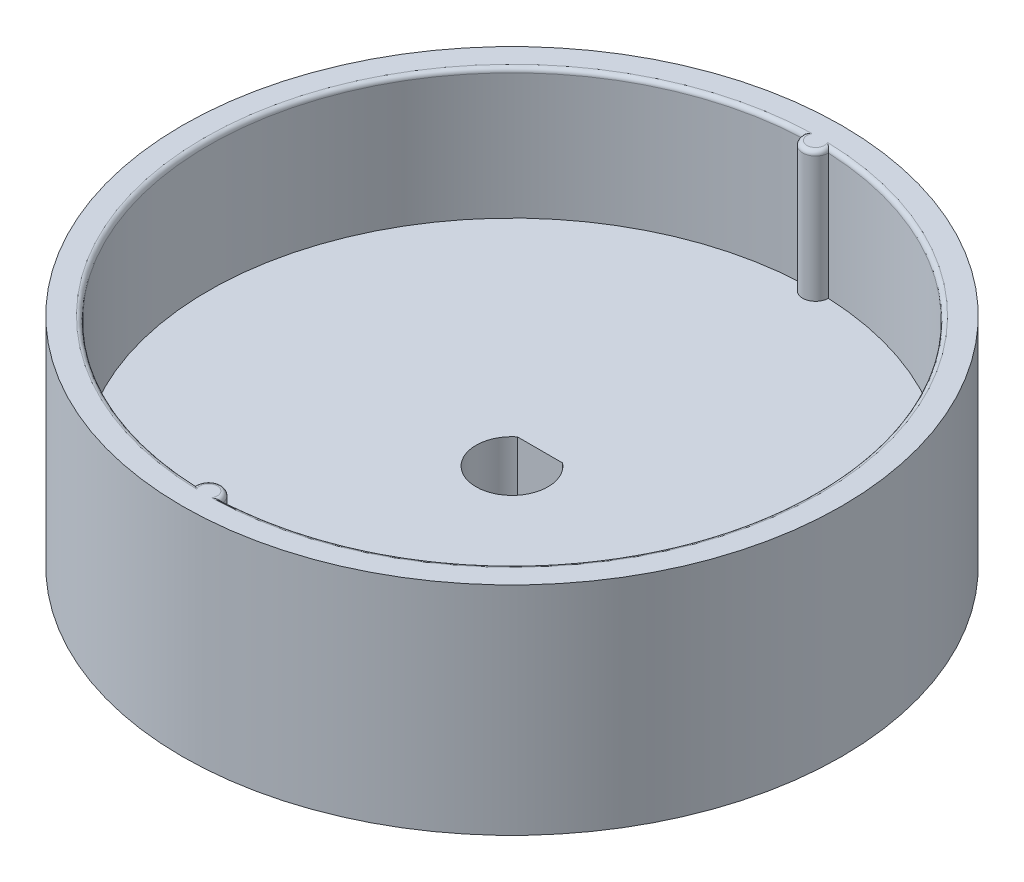
ISO-10303-21;
HEADER;
FILE_DESCRIPTION(('STEP AP214'),'2;1');
FILE_NAME('part.step','',(''),(''),'','','');
FILE_SCHEMA(('AUTOMOTIVE_DESIGN { 1 0 10303 214 1 1 1 1 }'));
ENDSEC;
DATA;
#1=APPLICATION_CONTEXT('core data for automotive mechanical design processes');
#2=APPLICATION_PROTOCOL_DEFINITION('international standard','automotive_design',2000,#1);
#3=PRODUCT_CONTEXT('',#1,'mechanical');
#4=PRODUCT('Part','Part','',(#3));
#5=PRODUCT_RELATED_PRODUCT_CATEGORY('part','',(#4));
#6=PRODUCT_DEFINITION_FORMATION('','',#4);
#7=PRODUCT_DEFINITION_CONTEXT('part definition',#1,'design');
#8=PRODUCT_DEFINITION('design','',#6,#7);
#9=PRODUCT_DEFINITION_SHAPE('','',#8);
#10=(LENGTH_UNIT() NAMED_UNIT(*) SI_UNIT(.MILLI.,.METRE.));
#11=(NAMED_UNIT(*) PLANE_ANGLE_UNIT() SI_UNIT($,.RADIAN.));
#12=(NAMED_UNIT(*) SI_UNIT($,.STERADIAN.) SOLID_ANGLE_UNIT());
#13=UNCERTAINTY_MEASURE_WITH_UNIT(LENGTH_MEASURE(1.E-05),#10,'distance_accuracy_value','');
#14=(GEOMETRIC_REPRESENTATION_CONTEXT(3) GLOBAL_UNCERTAINTY_ASSIGNED_CONTEXT((#13)) GLOBAL_UNIT_ASSIGNED_CONTEXT((#10,
#11,#12)) REPRESENTATION_CONTEXT('',''));
#15=CARTESIAN_POINT('',(0.,0.,0.));
#16=DIRECTION('',(0.,0.,1.));
#17=DIRECTION('',(1.,0.,0.));
#18=AXIS2_PLACEMENT_3D('',#15,#16,#17);
#19=CARTESIAN_POINT('',(0.,10.,0.));
#20=DIRECTION('',(0.,-1.,0.));
#21=DIRECTION('',(0.,0.,-1.));
#22=AXIS2_PLACEMENT_3D('',#19,#20,#21);
#23=CYLINDRICAL_SURFACE('',#22,4.15);
#24=DIRECTION('',(0.,-1.,0.));
#25=VECTOR('',#24,1.);
#26=CARTESIAN_POINT('',(2.61057837857858,10.,-3.22604719886397));
#27=LINE('',#26,#25);
#28=CARTESIAN_POINT('',(2.61057837857858,10.,-3.22604719886397));
#29=VERTEX_POINT('',#28);
#30=CARTESIAN_POINT('',(2.61057837857858,0.999999999999989,-3.22604719886397));
#31=VERTEX_POINT('',#30);
#32=EDGE_CURVE('E153',#29,#31,#27,.T.);
#33=ORIENTED_EDGE('',*,*,#32,.T.);
#34=CARTESIAN_POINT('',(0.,0.999999999999989,0.));
#35=DIRECTION('',(0.,1.,0.));
#36=DIRECTION('',(0.,0.,1.));
#37=AXIS2_PLACEMENT_3D('',#34,#35,#36);
#38=CIRCLE('',#37,4.15);
#39=CARTESIAN_POINT('',(-2.61057837857858,0.999999999999989,-3.22604719886397));
#40=VERTEX_POINT('',#39);
#41=EDGE_CURVE('E11',#31,#40,#38,.F.);
#42=ORIENTED_EDGE('',*,*,#41,.T.);
#43=DIRECTION('',(0.,-1.,0.));
#44=VECTOR('',#43,1.);
#45=CARTESIAN_POINT('',(-2.61057837857858,10.,-3.22604719886397));
#46=LINE('',#45,#44);
#47=CARTESIAN_POINT('',(-2.61057837857858,10.,-3.22604719886397));
#48=VERTEX_POINT('',#47);
#49=EDGE_CURVE('E155',#48,#40,#46,.T.);
#50=ORIENTED_EDGE('',*,*,#49,.F.);
#51=CARTESIAN_POINT('',(0.,10.,0.));
#52=DIRECTION('',(0.,1.,0.));
#53=DIRECTION('',(0.,0.,1.));
#54=AXIS2_PLACEMENT_3D('',#51,#52,#53);
#55=CIRCLE('',#54,4.15);
#56=EDGE_CURVE('E144',#48,#29,#55,.T.);
#57=ORIENTED_EDGE('',*,*,#56,.T.);
#58=EDGE_LOOP('',(#33,#42,#50,#57));
#59=FACE_BOUND('',#58,.T.);
#60=ADVANCED_FACE('F38',(#59),#23,.F.);
#61=CARTESIAN_POINT('',(0.,10.,-3.22604719886397));
#62=DIRECTION('',(0.,0.,1.));
#63=DIRECTION('',(1.,0.,0.));
#64=AXIS2_PLACEMENT_3D('',#61,#62,#63);
#65=PLANE('',#64);
#66=ORIENTED_EDGE('',*,*,#49,.T.);
#67=DIRECTION('',(1.,0.,0.));
#68=VECTOR('',#67,1.);
#69=CARTESIAN_POINT('',(2.61057837857858,0.999999999999989,-3.22604719886397));
#70=LINE('',#69,#68);
#71=EDGE_CURVE('E53',#40,#31,#70,.T.);
#72=ORIENTED_EDGE('',*,*,#71,.T.);
#73=ORIENTED_EDGE('',*,*,#32,.F.);
#74=DIRECTION('',(-1.,0.,0.));
#75=VECTOR('',#74,1.);
#76=CARTESIAN_POINT('',(0.,10.,-3.22604719886397));
#77=LINE('',#76,#75);
#78=EDGE_CURVE('E150',#29,#48,#77,.T.);
#79=ORIENTED_EDGE('',*,*,#78,.T.);
#80=EDGE_LOOP('',(#66,#72,#73,#79));
#81=FACE_BOUND('',#80,.T.);
#82=ADVANCED_FACE('F242',(#81),#65,.T.);
#83=CARTESIAN_POINT('',(0.,10.,0.));
#84=DIRECTION('',(0.,1.,0.));
#85=DIRECTION('',(0.,0.,1.));
#86=AXIS2_PLACEMENT_3D('',#83,#84,#85);
#87=PLANE('',#86);
#88=CARTESIAN_POINT('',(-0.000344427298581058,10.,34.9678571428571));
#89=DIRECTION('',(0.,1.,0.));
#90=DIRECTION('',(0.,0.,1.));
#91=AXIS2_PLACEMENT_3D('',#88,#89,#90);
#92=CIRCLE('',#91,1.5);
#93=CARTESIAN_POINT('',(1.49965557270142,10.,34.9678571428571));
#94=VERTEX_POINT('',#93);
#95=CARTESIAN_POINT('',(-1.50034442728045,10.,34.9678497639661));
#96=VERTEX_POINT('',#95);
#97=EDGE_CURVE('E138',#94,#96,#92,.T.);
#98=ORIENTED_EDGE('',*,*,#97,.F.);
#99=CARTESIAN_POINT('',(0.,10.,0.));
#100=DIRECTION('',(0.,1.,0.));
#101=DIRECTION('',(0.,0.,1.));
#102=AXIS2_PLACEMENT_3D('',#99,#100,#101);
#103=CIRCLE('',#102,35.);
#104=CARTESIAN_POINT('',(1.49965557270142,10.,-34.9678571428572));
#105=VERTEX_POINT('',#104);
#106=EDGE_CURVE('E120',#94,#105,#103,.T.);
#107=ORIENTED_EDGE('',*,*,#106,.T.);
#108=CARTESIAN_POINT('',(0.,10.,-35.));
#109=DIRECTION('',(0.,1.,0.));
#110=DIRECTION('',(0.,0.,1.));
#111=AXIS2_PLACEMENT_3D('',#108,#109,#110);
#112=CIRCLE('',#111,1.49999999999991);
#113=CARTESIAN_POINT('',(-1.49965604729446,10.,-34.9678792930825));
#114=VERTEX_POINT('',#113);
#115=EDGE_CURVE('E135',#114,#105,#112,.T.);
#116=ORIENTED_EDGE('',*,*,#115,.F.);
#117=CARTESIAN_POINT('',(0.,10.,0.));
#118=DIRECTION('',(0.,1.,0.));
#119=DIRECTION('',(0.,0.,1.));
#120=AXIS2_PLACEMENT_3D('',#117,#118,#119);
#121=CIRCLE('',#120,35.0000221502184);
#122=EDGE_CURVE('E142',#114,#96,#121,.T.);
#123=ORIENTED_EDGE('',*,*,#122,.T.);
#124=EDGE_LOOP('',(#98,#107,#116,#123));
#125=FACE_BOUND('',#124,.T.);
#126=ORIENTED_EDGE('',*,*,#56,.F.);
#127=ORIENTED_EDGE('',*,*,#78,.F.);
#128=EDGE_LOOP('',(#126,#127));
#129=FACE_BOUND('',#128,.T.);
#130=ADVANCED_FACE('F132',(#125,#129),#87,.T.);
#131=CARTESIAN_POINT('',(0.,0.,0.));
#132=DIRECTION('',(0.,1.,0.));
#133=DIRECTION('',(0.,0.,1.));
#134=AXIS2_PLACEMENT_3D('',#131,#132,#133);
#135=PLANE('',#134);
#136=CARTESIAN_POINT('',(0.,0.,0.));
#137=DIRECTION('',(0.,1.,0.));
#138=DIRECTION('',(0.,0.,1.));
#139=AXIS2_PLACEMENT_3D('',#136,#137,#138);
#140=CIRCLE('',#139,5.14999999999999);
#141=CARTESIAN_POINT('',(-2.94330172985611,0.,-4.22604719886395));
#142=VERTEX_POINT('',#141);
#143=CARTESIAN_POINT('',(2.94330172985611,0.,-4.22604719886396));
#144=VERTEX_POINT('',#143);
#145=EDGE_CURVE('E174',#142,#144,#140,.T.);
#146=ORIENTED_EDGE('',*,*,#145,.T.);
#147=DIRECTION('',(-1.,0.,0.));
#148=VECTOR('',#147,1.);
#149=CARTESIAN_POINT('',(-2.61057837857858,0.,-4.22604719886395));
#150=LINE('',#149,#148);
#151=EDGE_CURVE('E221',#144,#142,#150,.T.);
#152=ORIENTED_EDGE('',*,*,#151,.T.);
#153=EDGE_LOOP('',(#146,#152));
#154=FACE_BOUND('',#153,.T.);
#155=CARTESIAN_POINT('',(0.,0.,0.));
#156=DIRECTION('',(0.,1.,0.));
#157=DIRECTION('',(0.,0.,1.));
#158=AXIS2_PLACEMENT_3D('',#155,#156,#157);
#159=CIRCLE('',#158,38.);
#160=CARTESIAN_POINT('',(0.,0.,38.));
#161=VERTEX_POINT('',#160);
#162=EDGE_CURVE('E214',#161,#161,#159,.T.);
#163=ORIENTED_EDGE('',*,*,#162,.F.);
#164=EDGE_LOOP('',(#163));
#165=FACE_BOUND('',#164,.T.);
#166=ADVANCED_FACE('F249',(#154,#165),#135,.F.);
#167=CARTESIAN_POINT('',(0.,25.,0.));
#168=DIRECTION('',(0.,-1.,0.));
#169=DIRECTION('',(0.,0.,-1.));
#170=AXIS2_PLACEMENT_3D('',#167,#168,#169);
#171=CYLINDRICAL_SURFACE('',#170,35.);
#172=DIRECTION('',(0.,-1.,0.));
#173=VECTOR('',#172,1.);
#174=CARTESIAN_POINT('',(1.49965557270142,25.,34.9678571428571));
#175=LINE('',#174,#173);
#176=CARTESIAN_POINT('',(1.49965557270142,24.5,34.9678571428571));
#177=VERTEX_POINT('',#176);
#178=EDGE_CURVE('E290',#177,#94,#175,.T.);
#179=ORIENTED_EDGE('',*,*,#178,.F.);
#180=CARTESIAN_POINT('',(0.,24.5,0.));
#181=DIRECTION('',(0.,1.,0.));
#182=DIRECTION('',(0.,0.,1.));
#183=AXIS2_PLACEMENT_3D('',#180,#181,#182);
#184=CIRCLE('',#183,35.);
#185=CARTESIAN_POINT('',(1.49965557270142,24.5,-34.9678571428572));
#186=VERTEX_POINT('',#185);
#187=EDGE_CURVE('E122',#177,#186,#184,.T.);
#188=ORIENTED_EDGE('',*,*,#187,.T.);
#189=DIRECTION('',(0.,-1.,0.));
#190=VECTOR('',#189,1.);
#191=CARTESIAN_POINT('',(1.49965557270142,25.,-34.9678571428572));
#192=LINE('',#191,#190);
#193=EDGE_CURVE('E116',#186,#105,#192,.T.);
#194=ORIENTED_EDGE('',*,*,#193,.T.);
#195=ORIENTED_EDGE('',*,*,#106,.F.);
#196=EDGE_LOOP('',(#179,#188,#194,#195));
#197=FACE_BOUND('',#196,.T.);
#198=ADVANCED_FACE('F119',(#197),#171,.F.);
#199=CARTESIAN_POINT('',(-0.000344427298581058,25.,34.9678571428571));
#200=DIRECTION('',(0.,-1.,0.));
#201=DIRECTION('',(0.,0.,-1.));
#202=AXIS2_PLACEMENT_3D('',#199,#200,#201);
#203=CYLINDRICAL_SURFACE('',#202,1.5);
#204=DIRECTION('',(0.,-1.,0.));
#205=VECTOR('',#204,1.);
#206=CARTESIAN_POINT('',(-1.50034442728045,25.,34.9678497639661));
#207=LINE('',#206,#205);
#208=CARTESIAN_POINT('',(-1.50034442728045,24.5,34.9678497639661));
#209=VERTEX_POINT('',#208);
#210=EDGE_CURVE('E288',#209,#96,#207,.T.);
#211=ORIENTED_EDGE('',*,*,#210,.F.);
#212=CARTESIAN_POINT('',(-0.000344427298581058,24.5,34.9678571428571));
#213=DIRECTION('',(0.,1.,0.));
#214=DIRECTION('',(0.,0.,1.));
#215=AXIS2_PLACEMENT_3D('',#212,#213,#214);
#216=CIRCLE('',#215,1.5);
#217=EDGE_CURVE('E166',#209,#177,#216,.F.);
#218=ORIENTED_EDGE('',*,*,#217,.T.);
#219=ORIENTED_EDGE('',*,*,#178,.T.);
#220=ORIENTED_EDGE('',*,*,#97,.T.);
#221=EDGE_LOOP('',(#211,#218,#219,#220));
#222=FACE_BOUND('',#221,.T.);
#223=ADVANCED_FACE('F262',(#222),#203,.T.);
#224=CARTESIAN_POINT('',(0.,25.,0.));
#225=DIRECTION('',(0.,-1.,0.));
#226=DIRECTION('',(0.,0.,-1.));
#227=AXIS2_PLACEMENT_3D('',#224,#225,#226);
#228=CYLINDRICAL_SURFACE('',#227,35.0000221502184);
#229=DIRECTION('',(0.,-1.,0.));
#230=VECTOR('',#229,1.);
#231=CARTESIAN_POINT('',(-1.49965604729446,25.,-34.9678792930825));
#232=LINE('',#231,#230);
#233=CARTESIAN_POINT('',(-1.49965604729446,24.5,-34.9678792930825));
#234=VERTEX_POINT('',#233);
#235=EDGE_CURVE('E126',#234,#114,#232,.T.);
#236=ORIENTED_EDGE('',*,*,#235,.F.);
#237=CARTESIAN_POINT('',(0.,24.5,0.));
#238=DIRECTION('',(0.,1.,0.));
#239=DIRECTION('',(0.,0.,1.));
#240=AXIS2_PLACEMENT_3D('',#237,#238,#239);
#241=CIRCLE('',#240,35.0000221502184);
#242=EDGE_CURVE('E170',#234,#209,#241,.T.);
#243=ORIENTED_EDGE('',*,*,#242,.T.);
#244=ORIENTED_EDGE('',*,*,#210,.T.);
#245=ORIENTED_EDGE('',*,*,#122,.F.);
#246=EDGE_LOOP('',(#236,#243,#244,#245));
#247=FACE_BOUND('',#246,.T.);
#248=ADVANCED_FACE('F258',(#247),#228,.F.);
#249=CARTESIAN_POINT('',(0.,25.,0.));
#250=DIRECTION('',(0.,-1.,0.));
#251=DIRECTION('',(0.,0.,-1.));
#252=AXIS2_PLACEMENT_3D('',#249,#250,#251);
#253=CYLINDRICAL_SURFACE('',#252,38.);
#254=CARTESIAN_POINT('',(0.,25.,0.));
#255=DIRECTION('',(0.,1.,0.));
#256=DIRECTION('',(0.,0.,1.));
#257=AXIS2_PLACEMENT_3D('',#254,#255,#256);
#258=CIRCLE('',#257,38.);
#259=CARTESIAN_POINT('',(0.,25.,38.));
#260=VERTEX_POINT('',#259);
#261=EDGE_CURVE('E127',#260,#260,#258,.T.);
#262=ORIENTED_EDGE('',*,*,#261,.F.);
#263=EDGE_LOOP('',(#262));
#264=FACE_BOUND('',#263,.T.);
#265=ORIENTED_EDGE('',*,*,#162,.T.);
#266=EDGE_LOOP('',(#265));
#267=FACE_BOUND('',#266,.T.);
#268=ADVANCED_FACE('F255',(#264,#267),#253,.T.);
#269=CARTESIAN_POINT('',(0.,25.,-35.));
#270=DIRECTION('',(0.,-1.,0.));
#271=DIRECTION('',(0.,0.,-1.));
#272=AXIS2_PLACEMENT_3D('',#269,#270,#271);
#273=CYLINDRICAL_SURFACE('',#272,1.49999999999991);
#274=ORIENTED_EDGE('',*,*,#193,.F.);
#275=CARTESIAN_POINT('',(0.,24.5,-35.));
#276=DIRECTION('',(0.,1.,0.));
#277=DIRECTION('',(0.,0.,1.));
#278=AXIS2_PLACEMENT_3D('',#275,#276,#277);
#279=CIRCLE('',#278,1.49999999999991);
#280=EDGE_CURVE('E172',#186,#234,#279,.F.);
#281=ORIENTED_EDGE('',*,*,#280,.T.);
#282=ORIENTED_EDGE('',*,*,#235,.T.);
#283=ORIENTED_EDGE('',*,*,#115,.T.);
#284=EDGE_LOOP('',(#274,#281,#282,#283));
#285=FACE_BOUND('',#284,.T.);
#286=ADVANCED_FACE('F140',(#285),#273,.T.);
#287=CARTESIAN_POINT('',(0.,25.,0.));
#288=DIRECTION('',(0.,1.,0.));
#289=DIRECTION('',(0.,0.,1.));
#290=AXIS2_PLACEMENT_3D('',#287,#288,#289);
#291=PLANE('',#290);
#292=CARTESIAN_POINT('',(0.,25.,0.));
#293=DIRECTION('',(0.,1.,0.));
#294=DIRECTION('',(0.,0.,1.));
#295=AXIS2_PLACEMENT_3D('',#292,#293,#294);
#296=CIRCLE('',#295,35.5);
#297=CARTESIAN_POINT('',(0.872123551909785,25.,-35.4892857142857));
#298=VERTEX_POINT('',#297);
#299=CARTESIAN_POINT('',(0.852661330255749,25.,35.4897586446553));
#300=VERTEX_POINT('',#299);
#301=EDGE_CURVE('E161',#298,#300,#296,.F.);
#302=ORIENTED_EDGE('',*,*,#301,.T.);
#303=CARTESIAN_POINT('',(-0.000344427298581058,25.,34.9678571428571));
#304=DIRECTION('',(0.,1.,0.));
#305=DIRECTION('',(0.,0.,1.));
#306=AXIS2_PLACEMENT_3D('',#303,#304,#305);
#307=CIRCLE('',#306,1.);
#308=CARTESIAN_POINT('',(-0.853346707489282,25.,35.4897643280822));
#309=VERTEX_POINT('',#308);
#310=EDGE_CURVE('E163',#300,#309,#307,.T.);
#311=ORIENTED_EDGE('',*,*,#310,.T.);
#312=CARTESIAN_POINT('',(0.,25.,0.));
#313=DIRECTION('',(0.,1.,0.));
#314=DIRECTION('',(0.,0.,1.));
#315=AXIS2_PLACEMENT_3D('',#312,#313,#314);
#316=CIRCLE('',#315,35.5000221502184);
#317=CARTESIAN_POINT('',(-0.872110947106091,25.,-35.4893081809428));
#318=VERTEX_POINT('',#317);
#319=EDGE_CURVE('E159',#309,#318,#316,.F.);
#320=ORIENTED_EDGE('',*,*,#319,.T.);
#321=CARTESIAN_POINT('',(0.,25.,-35.));
#322=DIRECTION('',(0.,1.,0.));
#323=DIRECTION('',(0.,0.,1.));
#324=AXIS2_PLACEMENT_3D('',#321,#322,#323);
#325=CIRCLE('',#324,0.999999999999911);
#326=EDGE_CURVE('E157',#318,#298,#325,.T.);
#327=ORIENTED_EDGE('',*,*,#326,.T.);
#328=EDGE_LOOP('',(#302,#311,#320,#327));
#329=FACE_BOUND('',#328,.T.);
#330=ORIENTED_EDGE('',*,*,#261,.T.);
#331=EDGE_LOOP('',(#330));
#332=FACE_BOUND('',#331,.T.);
#333=ADVANCED_FACE('F271',(#329,#332),#291,.T.);
#334=CARTESIAN_POINT('',(0.,24.5,-35.));
#335=DIRECTION('',(0.,1.,0.));
#336=DIRECTION('',(0.,0.,1.));
#337=AXIS2_PLACEMENT_3D('',#334,#335,#336);
#338=TOROIDAL_SURFACE('',#337,0.999999999999911,0.5);
#339=CARTESIAN_POINT('',(-1.49965604729446,24.5,-34.9678792930825));
#340=CARTESIAN_POINT('',(-1.49968510968335,24.5219686152297,-34.9678400185327));
#341=CARTESIAN_POINT('',(-1.49824276810822,24.5438890449089,-34.9693865974401));
#342=CARTESIAN_POINT('',(-1.49266716930117,24.586818677745,-34.9753186199488));
#343=CARTESIAN_POINT('',(-1.48855533408124,24.6078337268752,-34.979681462169));
#344=CARTESIAN_POINT('',(-1.47789776299629,24.6484602732177,-34.9909097541989));
#345=CARTESIAN_POINT('',(-1.47135755620936,24.6680748391016,-34.9977695181583));
#346=CARTESIAN_POINT('',(-1.45617404730387,24.7056156718491,-35.013540515685));
#347=CARTESIAN_POINT('',(-1.44752658312126,24.7235384989372,-35.0224558072441));
#348=CARTESIAN_POINT('',(-1.42495375549343,24.7637310246039,-35.0454529239525));
#349=CARTESIAN_POINT('',(-1.41025755982334,24.7851702624031,-35.0602282263967));
#350=CARTESIAN_POINT('',(-1.37832271242707,24.8244211193011,-35.0916982895244));
#351=CARTESIAN_POINT('',(-1.36107981768764,24.8422265639518,-35.10839624307));
#352=CARTESIAN_POINT('',(-1.3168211049268,24.8813130828523,-35.1502792799531));
#353=CARTESIAN_POINT('',(-1.28878272917472,24.9008162084063,-35.1760361583146));
#354=CARTESIAN_POINT('',(-1.22985267588707,24.933784467943,-35.2281163214808));
#355=CARTESIAN_POINT('',(-1.19895515053014,24.9472368819098,-35.2544406787223));
#356=CARTESIAN_POINT('',(-1.12199100933566,24.973532907572,-35.3171839607803));
#357=CARTESIAN_POINT('',(-1.07487604181798,24.9838918882704,-35.3533424598639));
#358=CARTESIAN_POINT('',(-0.977648379898187,24.9970481873393,-35.4226356818184));
#359=CARTESIAN_POINT('',(-0.927538365601914,24.9998521657125,-35.4557730430114));
#360=CARTESIAN_POINT('',(-0.874864415061139,24.9999980982767,-35.487648030681));
#361=CARTESIAN_POINT('',(-0.873488105125747,24.9999999952838,-35.4884788645733));
#362=CARTESIAN_POINT('',(-0.87211094710609,25.,-35.4893081809428));
#363=B_SPLINE_CURVE_WITH_KNOTS('',3,(#339,#340,#341,#342,#343,#344,#345,#346,#347,#348,#349,
#350,#351,#352,#353,#354,#355,#356,#357,#358,#359,#360,#361,#362),.UNSPECIFIED.,.F.,.F.,(4,2,2,
2,2,2,2,2,2,2,2,4),(0.,0.0657279068460849,0.130934776689787,0.195994080633927,0.261182940428459,
0.350382871630335,0.439733129784174,0.5673544875939,0.695242895659755,0.875275512336338,
1.05514937186774,1.05997229094906),.UNSPECIFIED.);
#364=EDGE_CURVE('E215',#234,#318,#363,.T.);
#365=ORIENTED_EDGE('',*,*,#364,.F.);
#366=ORIENTED_EDGE('',*,*,#280,.F.);
#367=CARTESIAN_POINT('',(1.49965557270142,24.5,-34.9678571428571));
#368=CARTESIAN_POINT('',(1.49968463451634,24.5219687165264,-34.9678178683996));
#369=CARTESIAN_POINT('',(1.49824230224663,24.5438892483236,-34.9693644602242));
#370=CARTESIAN_POINT('',(1.49266673640202,24.5868190877111,-34.97529653562));
#371=CARTESIAN_POINT('',(1.48855492436185,24.6078342411745,-34.9796594179778));
#372=CARTESIAN_POINT('',(1.47789740845996,24.6484609956063,-34.9908878187629));
#373=CARTESIAN_POINT('',(1.47135723350745,24.6680756651677,-34.9977476514283));
#374=CARTESIAN_POINT('',(1.4561737916958,24.7056166981965,-35.0135188143977));
#375=CARTESIAN_POINT('',(1.44752636285934,24.723539621942,-35.0224342026713));
#376=CARTESIAN_POINT('',(1.42495366952902,24.7637322701566,-35.0454315266128));
#377=CARTESIAN_POINT('',(1.41025758550147,24.7851715428366,-35.0602069391594));
#378=CARTESIAN_POINT('',(1.37832297065521,24.8244224641013,-35.091677250436));
#379=CARTESIAN_POINT('',(1.36108019687798,24.8422279382873,-35.1083753420452));
#380=CARTESIAN_POINT('',(1.31682193441714,24.8813143724831,-35.1502585984358));
#381=CARTESIAN_POINT('',(1.28878391259613,24.900817416863,-35.176015558086));
#382=CARTESIAN_POINT('',(1.22985458992349,24.9337855281775,-35.2280959216323));
#383=CARTESIAN_POINT('',(1.19895744141138,24.947237875383,-35.2544203980247));
#384=CARTESIAN_POINT('',(1.12199517505101,24.9735334009638,-35.3171632367218));
#385=CARTESIAN_POINT('',(1.07488180105549,24.9838921552029,-35.3533212146068));
#386=CARTESIAN_POINT('',(0.977657446909788,24.997048206603,-35.4226136234672));
#387=CARTESIAN_POINT('',(0.927549146944908,24.9998521640443,-35.4557506927427));
#388=CARTESIAN_POINT('',(0.874876977429163,24.9999980982211,-35.4876255405854));
#389=CARTESIAN_POINT('',(0.873500688711347,24.9999999952842,-35.488456386175));
#390=CARTESIAN_POINT('',(0.872123551909782,25.,-35.4892857142857));
#391=B_SPLINE_CURVE_WITH_KNOTS('',3,(#367,#368,#369,#370,#371,#372,#373,#374,#375,#376,#377,
#378,#379,#380,#381,#382,#383,#384,#385,#386,#387,#388,#389,#390),.UNSPECIFIED.,.F.,.F.,(4,2,2,
2,2,2,2,2,2,2,2,4),(0.,0.0657282122123004,0.130935393791402,0.195995012722106,0.261184185623862,
0.350384190696548,0.439734521435094,0.567355223754483,0.695242969601874,0.875270841065852,
1.05513994863037,1.05996283135427),.UNSPECIFIED.);
#392=EDGE_CURVE('E207',#298,#186,#391,.F.);
#393=ORIENTED_EDGE('',*,*,#392,.F.);
#394=ORIENTED_EDGE('',*,*,#326,.F.);
#395=EDGE_LOOP('',(#365,#366,#393,#394));
#396=FACE_BOUND('',#395,.T.);
#397=ADVANCED_FACE('F202',(#396),#338,.T.);
#398=CARTESIAN_POINT('',(0.,24.5,0.));
#399=DIRECTION('',(0.,1.,0.));
#400=DIRECTION('',(0.,0.,1.));
#401=AXIS2_PLACEMENT_3D('',#398,#399,#400);
#402=TOROIDAL_SURFACE('',#401,35.5,0.5);
#403=ORIENTED_EDGE('',*,*,#392,.T.);
#404=ORIENTED_EDGE('',*,*,#187,.F.);
#405=CARTESIAN_POINT('',(1.49965557270142,24.5,34.9678571428571));
#406=CARTESIAN_POINT('',(1.49968547503869,24.5218212106685,34.967817736228));
#407=CARTESIAN_POINT('',(1.49822971668445,24.5435930250475,34.9693456055154));
#408=CARTESIAN_POINT('',(1.49260670737554,24.586221972499,34.9752010175027));
#409=CARTESIAN_POINT('',(1.48846158027204,24.6070850994354,34.9795057152241));
#410=CARTESIAN_POINT('',(1.47772496099431,24.6474085260552,34.9905764582071));
#411=CARTESIAN_POINT('',(1.47113924719389,24.6668720106181,34.9973366889633));
#412=CARTESIAN_POINT('',(1.45586011561944,24.7041208713293,35.0128680538802));
#413=CARTESIAN_POINT('',(1.44716240879352,24.7219027289941,35.0216432781086));
#414=CARTESIAN_POINT('',(1.4243971815878,24.7619146310608,35.0443392806147));
#415=CARTESIAN_POINT('',(1.40954052372361,24.7833012454054,35.058953851757));
#416=CARTESIAN_POINT('',(1.37727194149055,24.8224548818751,35.0900616962134));
#417=CARTESIAN_POINT('',(1.35985569652841,24.8402156600261,35.1065581353796));
#418=CARTESIAN_POINT('',(1.31494581057149,24.8794218835509,35.1481184997901));
#419=CARTESIAN_POINT('',(1.28639379556333,24.8990412435721,35.1737539950198));
#420=CARTESIAN_POINT('',(1.22640408043175,24.9322219271494,35.225535912286));
#421=CARTESIAN_POINT('',(1.19496029839605,24.9457701137353,35.2516833157174));
#422=CARTESIAN_POINT('',(1.11520487811854,24.972810942506,35.3150896115428));
#423=CARTESIAN_POINT('',(1.06569885873492,24.9835043612635,35.3520225944508));
#424=CARTESIAN_POINT('',(0.963507502390359,24.9970231394172,35.4225114340548));
#425=CARTESIAN_POINT('',(0.910824709121498,24.9998547106406,35.4560699367864));
#426=CARTESIAN_POINT('',(0.855478387026718,24.999998178938,35.488132893783));
#427=CARTESIAN_POINT('',(0.854070283078637,24.9999999946107,35.4889465613294));
#428=CARTESIAN_POINT('',(0.85266133025574,25.,35.4897586446553));
#429=B_SPLINE_CURVE_WITH_KNOTS('',3,(#405,#406,#407,#408,#409,#410,#411,#412,#413,#414,#415,
#416,#417,#418,#419,#420,#421,#422,#423,#424,#425,#426,#427,#428),.UNSPECIFIED.,.F.,.F.,(4,2,2,
2,2,2,2,2,2,2,2,4),(0.,0.0652835092723959,0.130036664716464,0.194637478914298,0.259370598579532,
0.348458020353078,0.437697587041112,0.566268625619262,0.695116541981887,0.882268283880221,
1.06927211072472,1.07415096574431),.UNSPECIFIED.);
#430=EDGE_CURVE('E183',#300,#177,#429,.F.);
#431=ORIENTED_EDGE('',*,*,#430,.F.);
#432=ORIENTED_EDGE('',*,*,#301,.F.);
#433=EDGE_LOOP('',(#403,#404,#431,#432));
#434=FACE_BOUND('',#433,.T.);
#435=ADVANCED_FACE('F197',(#434),#402,.T.);
#436=CARTESIAN_POINT('',(0.,24.5,0.));
#437=DIRECTION('',(0.,1.,0.));
#438=DIRECTION('',(0.,0.,1.));
#439=AXIS2_PLACEMENT_3D('',#436,#437,#438);
#440=TOROIDAL_SURFACE('',#439,35.5000221502184,0.5);
#441=ORIENTED_EDGE('',*,*,#364,.T.);
#442=ORIENTED_EDGE('',*,*,#319,.F.);
#443=CARTESIAN_POINT('',(-1.50034442728044,24.5,34.9678497639661));
#444=CARTESIAN_POINT('',(-1.50037432942651,24.5218211088334,34.9678103566597));
#445=CARTESIAN_POINT('',(-1.49891859192668,24.5435928205305,34.9693382416999));
#446=CARTESIAN_POINT('',(-1.49329566536388,24.5862215601742,34.975193711545));
#447=CARTESIAN_POINT('',(-1.48915060019276,24.6070845820884,34.9794984507686));
#448=CARTESIAN_POINT('',(-1.47841414481689,24.6474077990859,34.9905692964765));
#449=CARTESIAN_POINT('',(-1.47182853304625,24.6668711791303,34.9973295882529));
#450=CARTESIAN_POINT('',(-1.45654964214042,24.7041198377718,35.0128610887836));
#451=CARTESIAN_POINT('',(-1.44785207394552,24.7219015978305,35.0216363877118));
#452=CARTESIAN_POINT('',(-1.42508716214737,24.7619133734721,35.0443326300693));
#453=CARTESIAN_POINT('',(-1.41023068217688,24.7832999501217,35.0589473818947));
#454=CARTESIAN_POINT('',(-1.37796248430213,24.8224535168719,35.0900556097531));
#455=CARTESIAN_POINT('',(-1.36054644581473,24.840214262952,35.106552251703));
#456=CARTESIAN_POINT('',(-1.31563693006616,24.8794205666347,35.148113273985));
#457=CARTESIAN_POINT('',(-1.28708506527578,24.8990400056068,35.173749244659));
#458=CARTESIAN_POINT('',(-1.2270956388024,24.9322208335873,35.2255321309573));
#459=CARTESIAN_POINT('',(-1.19565199506473,24.9457690853375,35.25168002803));
#460=CARTESIAN_POINT('',(-1.11589584742402,24.9728104411199,35.315088364028));
#461=CARTESIAN_POINT('',(-1.06638884998184,24.9835040944099,35.3520228678318));
#462=CARTESIAN_POINT('',(-0.964195341418017,24.9970231243509,35.4225145533769));
#463=CARTESIAN_POINT('',(-0.911511373930717,24.9998547124868,35.4560743810902));
#464=CARTESIAN_POINT('',(-0.856163777575102,24.9999981789936,35.4881385457713));
#465=CARTESIAN_POINT('',(-0.854755666985457,24.9999999946102,35.4889522290527));
#466=CARTESIAN_POINT('',(-0.853346707489269,25.,35.4897643280822));
#467=B_SPLINE_CURVE_WITH_KNOTS('',3,(#443,#444,#445,#446,#447,#448,#449,#450,#451,#452,#453,
#454,#455,#456,#457,#458,#459,#460,#461,#462,#463,#464,#465,#466),.UNSPECIFIED.,.F.,.F.,(4,2,2,
2,2,2,2,2,2,2,2,4),(0.,0.0652832022343267,0.130036044173681,0.194636541538958,0.259369346280446,
0.348456686667526,0.437696173185782,0.566267864876932,0.695116441172922,0.882273257821051,
1.06928216765985,1.0741610635488),.UNSPECIFIED.);
#468=EDGE_CURVE('E175',#209,#309,#467,.T.);
#469=ORIENTED_EDGE('',*,*,#468,.F.);
#470=ORIENTED_EDGE('',*,*,#242,.F.);
#471=EDGE_LOOP('',(#441,#442,#469,#470));
#472=FACE_BOUND('',#471,.T.);
#473=ADVANCED_FACE('F190',(#472),#440,.T.);
#474=CARTESIAN_POINT('',(-0.000344427298581058,24.5,34.9678571428571));
#475=DIRECTION('',(0.,1.,0.));
#476=DIRECTION('',(0.,0.,1.));
#477=AXIS2_PLACEMENT_3D('',#474,#475,#476);
#478=TOROIDAL_SURFACE('',#477,1.,0.5);
#479=ORIENTED_EDGE('',*,*,#430,.T.);
#480=ORIENTED_EDGE('',*,*,#217,.F.);
#481=ORIENTED_EDGE('',*,*,#468,.T.);
#482=ORIENTED_EDGE('',*,*,#310,.F.);
#483=EDGE_LOOP('',(#479,#480,#481,#482));
#484=FACE_BOUND('',#483,.T.);
#485=ADVANCED_FACE('F193',(#484),#478,.T.);
#486=CARTESIAN_POINT('',(0.,0.,0.));
#487=DIRECTION('',(0.,-1.,0.));
#488=DIRECTION('',(0.,0.,-1.));
#489=AXIS2_PLACEMENT_3D('',#486,#487,#488);
#490=CONICAL_SURFACE('',#489,5.14999999999999,0.785398163397448);
#491=CARTESIAN_POINT('',(-2.94330172985611,0.,-4.22604719886395));
#492=CARTESIAN_POINT('',(-2.91706389745596,0.0835779494369271,-4.14246924942703));
#493=CARTESIAN_POINT('',(-2.89049408103524,0.167104055307135,-4.05894314355682));
#494=CARTESIAN_POINT('',(-2.83663274993366,0.334035879094857,-3.8920113197691));
#495=CARTESIAN_POINT('',(-2.80934126746283,0.417441602210757,-3.8086055966532));
#496=CARTESIAN_POINT('',(-2.75397622866055,0.584124366503055,-3.6419228323609));
#497=CARTESIAN_POINT('',(-2.72590266335756,0.667401406191707,-3.55864579267225));
#498=CARTESIAN_POINT('',(-2.66890001718085,0.833812821800533,-3.39223437706342));
#499=CARTESIAN_POINT('',(-2.63997089821772,0.916947191194141,-3.30910000766981));
#500=CARTESIAN_POINT('',(-2.61057837857858,0.999999999999989,-3.22604719886397));
#501=B_SPLINE_CURVE_WITH_KNOTS('',3,(#491,#492,#493,#494,#495,#496,#497,#498,#499,#500),
.UNSPECIFIED.,.F.,.F.,(4,2,2,2,4),(0.,0.363222762511336,0.726429340627717,1.08964008692604,
1.45286702784892),.UNSPECIFIED.);
#502=EDGE_CURVE('E225',#40,#142,#501,.F.);
#503=ORIENTED_EDGE('',*,*,#502,.F.);
#504=ORIENTED_EDGE('',*,*,#41,.F.);
#505=CARTESIAN_POINT('',(2.61057837857858,0.999999999999989,-3.22604719886397));
#506=CARTESIAN_POINT('',(2.63997089821772,0.916947191194141,-3.30910000766981));
#507=CARTESIAN_POINT('',(2.66890001718085,0.833812821800532,-3.39223437706342));
#508=CARTESIAN_POINT('',(2.72590266335756,0.667401406191707,-3.55864579267225));
#509=CARTESIAN_POINT('',(2.75397622866054,0.584124366503055,-3.6419228323609));
#510=CARTESIAN_POINT('',(2.80934126746283,0.417441602210757,-3.8086055966532));
#511=CARTESIAN_POINT('',(2.83663274993366,0.334035879094858,-3.8920113197691));
#512=CARTESIAN_POINT('',(2.89049408103524,0.167104055307136,-4.05894314355682));
#513=CARTESIAN_POINT('',(2.91706389745596,0.0835779494369275,-4.14246924942703));
#514=CARTESIAN_POINT('',(2.94330172985611,0.,-4.22604719886395));
#515=B_SPLINE_CURVE_WITH_KNOTS('',3,(#505,#506,#507,#508,#509,#510,#511,#512,#513,#514),
.UNSPECIFIED.,.F.,.F.,(4,2,2,2,4),(0.,0.36322694092288,0.726437687221204,1.08964426533758,
1.45286702784892),.UNSPECIFIED.);
#516=EDGE_CURVE('E44',#144,#31,#515,.F.);
#517=ORIENTED_EDGE('',*,*,#516,.F.);
#518=ORIENTED_EDGE('',*,*,#145,.F.);
#519=EDGE_LOOP('',(#503,#504,#517,#518));
#520=FACE_BOUND('',#519,.T.);
#521=ADVANCED_FACE('F41',(#520),#490,.F.);
#522=CARTESIAN_POINT('',(0.,0.,-4.22604719886395));
#523=DIRECTION('',(0.,-0.707106781186547,0.707106781186548));
#524=DIRECTION('',(1.,0.,0.));
#525=AXIS2_PLACEMENT_3D('',#522,#523,#524);
#526=PLANE('',#525);
#527=ORIENTED_EDGE('',*,*,#516,.T.);
#528=ORIENTED_EDGE('',*,*,#71,.F.);
#529=ORIENTED_EDGE('',*,*,#502,.T.);
#530=ORIENTED_EDGE('',*,*,#151,.F.);
#531=EDGE_LOOP('',(#527,#528,#529,#530));
#532=FACE_BOUND('',#531,.T.);
#533=ADVANCED_FACE('F231',(#532),#526,.T.);
#534=CLOSED_SHELL('',(#60,#82,#130,#166,#198,#223,#248,#268,#286,#333,#397,#435,#473,#485,#521,#533));
#535=MANIFOLD_SOLID_BREP('B2',#534);
#536=ADVANCED_BREP_SHAPE_REPRESENTATION('',(#18,#535),#14);
#537=SHAPE_DEFINITION_REPRESENTATION(#9,#536);
ENDSEC;
END-ISO-10303-21;
